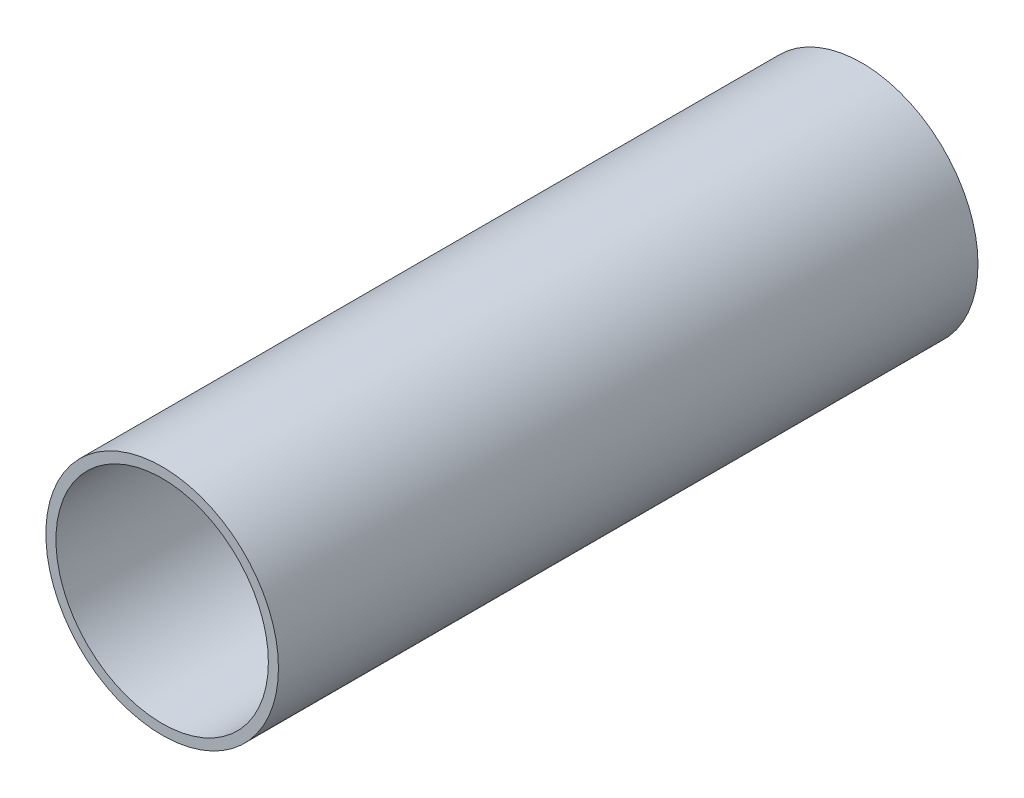
ISO-10303-21;
HEADER;
FILE_DESCRIPTION(('STEP AP214'),'2;1');
FILE_NAME('part.step','',(''),(''),'','','');
FILE_SCHEMA(('AUTOMOTIVE_DESIGN { 1 0 10303 214 1 1 1 1 }'));
ENDSEC;
DATA;
#1=APPLICATION_CONTEXT('core data for automotive mechanical design processes');
#2=APPLICATION_PROTOCOL_DEFINITION('international standard','automotive_design',2000,#1);
#3=PRODUCT_CONTEXT('',#1,'mechanical');
#4=PRODUCT('Part','Part','',(#3));
#5=PRODUCT_RELATED_PRODUCT_CATEGORY('part','',(#4));
#6=PRODUCT_DEFINITION_FORMATION('','',#4);
#7=PRODUCT_DEFINITION_CONTEXT('part definition',#1,'design');
#8=PRODUCT_DEFINITION('design','',#6,#7);
#9=PRODUCT_DEFINITION_SHAPE('','',#8);
#10=(LENGTH_UNIT() NAMED_UNIT(*) SI_UNIT(.MILLI.,.METRE.));
#11=(NAMED_UNIT(*) PLANE_ANGLE_UNIT() SI_UNIT($,.RADIAN.));
#12=(NAMED_UNIT(*) SI_UNIT($,.STERADIAN.) SOLID_ANGLE_UNIT());
#13=UNCERTAINTY_MEASURE_WITH_UNIT(LENGTH_MEASURE(1.E-05),#10,'distance_accuracy_value','');
#14=(GEOMETRIC_REPRESENTATION_CONTEXT(3) GLOBAL_UNCERTAINTY_ASSIGNED_CONTEXT((#13)) GLOBAL_UNIT_ASSIGNED_CONTEXT((#10,
#11,#12)) REPRESENTATION_CONTEXT('',''));
#15=CARTESIAN_POINT('',(0.,0.,0.));
#16=DIRECTION('',(0.,0.,1.));
#17=DIRECTION('',(1.,0.,0.));
#18=AXIS2_PLACEMENT_3D('',#15,#16,#17);
#19=CARTESIAN_POINT('',(0.,0.,57.2897));
#20=DIRECTION('',(0.,0.,1.));
#21=DIRECTION('',(1.,0.,0.));
#22=AXIS2_PLACEMENT_3D('',#19,#20,#21);
#23=CYLINDRICAL_SURFACE('',#22,17.399);
#24=CARTESIAN_POINT('',(0.,0.,-57.2897));
#25=DIRECTION('',(0.,0.,1.));
#26=DIRECTION('',(1.,0.,0.));
#27=AXIS2_PLACEMENT_3D('',#24,#25,#26);
#28=CIRCLE('',#27,17.399);
#29=CARTESIAN_POINT('',(17.399,0.,-57.2897));
#30=VERTEX_POINT('',#29);
#31=EDGE_CURVE('E26',#30,#30,#28,.T.);
#32=ORIENTED_EDGE('',*,*,#31,.F.);
#33=EDGE_LOOP('',(#32));
#34=FACE_BOUND('',#33,.T.);
#35=CARTESIAN_POINT('',(0.,0.,57.2897));
#36=DIRECTION('',(0.,0.,1.));
#37=DIRECTION('',(1.,0.,0.));
#38=AXIS2_PLACEMENT_3D('',#35,#36,#37);
#39=CIRCLE('',#38,17.399);
#40=CARTESIAN_POINT('',(17.399,0.,57.2897));
#41=VERTEX_POINT('',#40);
#42=EDGE_CURVE('E17',#41,#41,#39,.T.);
#43=ORIENTED_EDGE('',*,*,#42,.T.);
#44=EDGE_LOOP('',(#43));
#45=FACE_BOUND('',#44,.T.);
#46=ADVANCED_FACE('F14',(#34,#45),#23,.F.);
#47=CARTESIAN_POINT('',(0.,0.,57.2897));
#48=DIRECTION('',(0.,0.,-1.));
#49=DIRECTION('',(-1.,0.,0.));
#50=AXIS2_PLACEMENT_3D('',#47,#48,#49);
#51=PLANE('',#50);
#52=CARTESIAN_POINT('',(0.,0.,57.2897));
#53=DIRECTION('',(0.,0.,1.));
#54=DIRECTION('',(1.,0.,0.));
#55=AXIS2_PLACEMENT_3D('',#52,#53,#54);
#56=CIRCLE('',#55,19.05);
#57=CARTESIAN_POINT('',(19.05,0.,57.2897));
#58=VERTEX_POINT('',#57);
#59=EDGE_CURVE('E21',#58,#58,#56,.F.);
#60=ORIENTED_EDGE('',*,*,#59,.F.);
#61=EDGE_LOOP('',(#60));
#62=FACE_BOUND('',#61,.T.);
#63=ORIENTED_EDGE('',*,*,#42,.F.);
#64=EDGE_LOOP('',(#63));
#65=FACE_BOUND('',#64,.T.);
#66=ADVANCED_FACE('F35',(#62,#65),#51,.F.);
#67=CARTESIAN_POINT('',(0.,0.,-57.2897));
#68=DIRECTION('',(0.,0.,-1.));
#69=DIRECTION('',(-1.,0.,0.));
#70=AXIS2_PLACEMENT_3D('',#67,#68,#69);
#71=PLANE('',#70);
#72=CARTESIAN_POINT('',(0.,0.,-57.2897));
#73=DIRECTION('',(0.,0.,1.));
#74=DIRECTION('',(1.,0.,0.));
#75=AXIS2_PLACEMENT_3D('',#72,#73,#74);
#76=CIRCLE('',#75,19.05);
#77=CARTESIAN_POINT('',(19.05,0.,-57.2897));
#78=VERTEX_POINT('',#77);
#79=EDGE_CURVE('E10',#78,#78,#76,.T.);
#80=ORIENTED_EDGE('',*,*,#79,.F.);
#81=EDGE_LOOP('',(#80));
#82=FACE_BOUND('',#81,.T.);
#83=ORIENTED_EDGE('',*,*,#31,.T.);
#84=EDGE_LOOP('',(#83));
#85=FACE_BOUND('',#84,.T.);
#86=ADVANCED_FACE('F37',(#82,#85),#71,.T.);
#87=CARTESIAN_POINT('',(0.,0.,57.2897));
#88=DIRECTION('',(0.,0.,1.));
#89=DIRECTION('',(1.,0.,0.));
#90=AXIS2_PLACEMENT_3D('',#87,#88,#89);
#91=CYLINDRICAL_SURFACE('',#90,19.05);
#92=ORIENTED_EDGE('',*,*,#79,.T.);
#93=EDGE_LOOP('',(#92));
#94=FACE_BOUND('',#93,.T.);
#95=ORIENTED_EDGE('',*,*,#59,.T.);
#96=EDGE_LOOP('',(#95));
#97=FACE_BOUND('',#96,.T.);
#98=ADVANCED_FACE('F44',(#94,#97),#91,.T.);
#99=CLOSED_SHELL('',(#46,#66,#86,#98));
#100=MANIFOLD_SOLID_BREP('B1',#99);
#101=ADVANCED_BREP_SHAPE_REPRESENTATION('',(#18,#100),#14);
#102=SHAPE_DEFINITION_REPRESENTATION(#9,#101);
ENDSEC;
END-ISO-10303-21;
